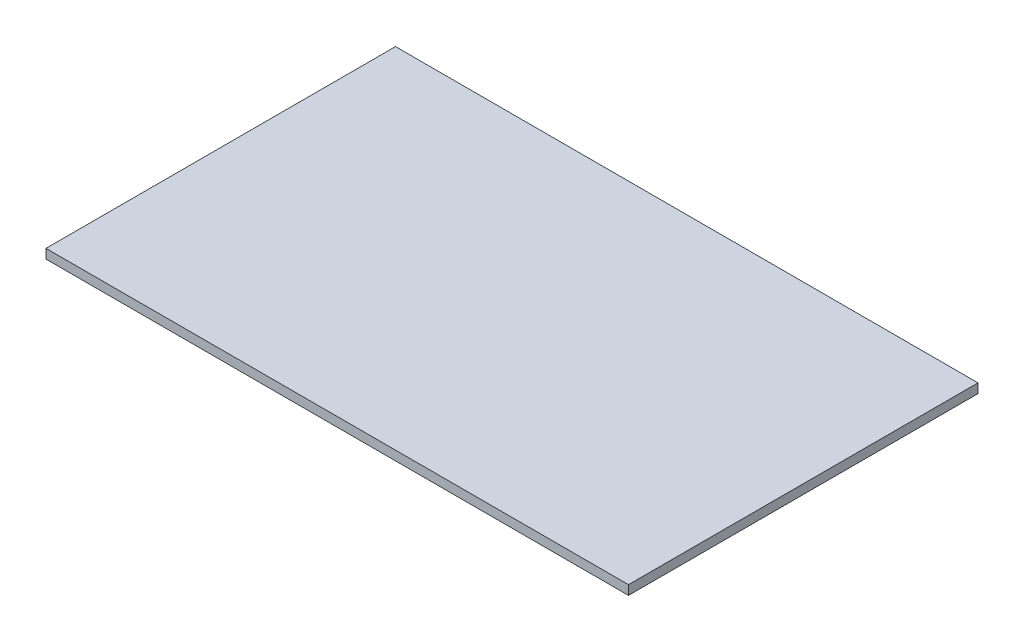
ISO-10303-21;
HEADER;
FILE_DESCRIPTION(('STEP AP214'),'2;1');
FILE_NAME('part.step','',(''),(''),'','','');
FILE_SCHEMA(('AUTOMOTIVE_DESIGN { 1 0 10303 214 1 1 1 1 }'));
ENDSEC;
DATA;
#1=APPLICATION_CONTEXT('core data for automotive mechanical design processes');
#2=APPLICATION_PROTOCOL_DEFINITION('international standard','automotive_design',2000,#1);
#3=PRODUCT_CONTEXT('',#1,'mechanical');
#4=PRODUCT('Part','Part','',(#3));
#5=PRODUCT_RELATED_PRODUCT_CATEGORY('part','',(#4));
#6=PRODUCT_DEFINITION_FORMATION('','',#4);
#7=PRODUCT_DEFINITION_CONTEXT('part definition',#1,'design');
#8=PRODUCT_DEFINITION('design','',#6,#7);
#9=PRODUCT_DEFINITION_SHAPE('','',#8);
#10=(LENGTH_UNIT() NAMED_UNIT(*) SI_UNIT(.MILLI.,.METRE.));
#11=(NAMED_UNIT(*) PLANE_ANGLE_UNIT() SI_UNIT($,.RADIAN.));
#12=(NAMED_UNIT(*) SI_UNIT($,.STERADIAN.) SOLID_ANGLE_UNIT());
#13=UNCERTAINTY_MEASURE_WITH_UNIT(LENGTH_MEASURE(1.E-05),#10,'distance_accuracy_value','');
#14=(GEOMETRIC_REPRESENTATION_CONTEXT(3) GLOBAL_UNCERTAINTY_ASSIGNED_CONTEXT((#13)) GLOBAL_UNIT_ASSIGNED_CONTEXT((#10,
#11,#12)) REPRESENTATION_CONTEXT('',''));
#15=CARTESIAN_POINT('',(0.,0.,0.));
#16=DIRECTION('',(0.,0.,1.));
#17=DIRECTION('',(1.,0.,0.));
#18=AXIS2_PLACEMENT_3D('',#15,#16,#17);
#19=CARTESIAN_POINT('',(50.,1.6,30.));
#20=DIRECTION('',(-1.,0.,0.));
#21=DIRECTION('',(0.,0.,1.));
#22=AXIS2_PLACEMENT_3D('',#19,#20,#21);
#23=PLANE('',#22);
#24=DIRECTION('',(0.,0.,-1.));
#25=VECTOR('',#24,1.);
#26=CARTESIAN_POINT('',(50.,0.,30.));
#27=LINE('',#26,#25);
#28=CARTESIAN_POINT('',(50.,0.,30.));
#29=VERTEX_POINT('',#28);
#30=CARTESIAN_POINT('',(50.,0.,-30.));
#31=VERTEX_POINT('',#30);
#32=EDGE_CURVE('E96',#29,#31,#27,.T.);
#33=ORIENTED_EDGE('',*,*,#32,.T.);
#34=DIRECTION('',(0.,-1.,0.));
#35=VECTOR('',#34,1.);
#36=CARTESIAN_POINT('',(50.,1.6,-30.));
#37=LINE('',#36,#35);
#38=CARTESIAN_POINT('',(50.,1.6,-30.));
#39=VERTEX_POINT('',#38);
#40=EDGE_CURVE('E11',#39,#31,#37,.T.);
#41=ORIENTED_EDGE('',*,*,#40,.F.);
#42=DIRECTION('',(0.,0.,-1.));
#43=VECTOR('',#42,1.);
#44=CARTESIAN_POINT('',(50.,1.6,30.));
#45=LINE('',#44,#43);
#46=CARTESIAN_POINT('',(50.,1.6,30.));
#47=VERTEX_POINT('',#46);
#48=EDGE_CURVE('E84',#47,#39,#45,.T.);
#49=ORIENTED_EDGE('',*,*,#48,.F.);
#50=DIRECTION('',(0.,-1.,0.));
#51=VECTOR('',#50,1.);
#52=CARTESIAN_POINT('',(50.,1.6,30.));
#53=LINE('',#52,#51);
#54=EDGE_CURVE('E92',#47,#29,#53,.T.);
#55=ORIENTED_EDGE('',*,*,#54,.T.);
#56=EDGE_LOOP('',(#33,#41,#49,#55));
#57=FACE_BOUND('',#56,.T.);
#58=ADVANCED_FACE('F33',(#57),#23,.F.);
#59=CARTESIAN_POINT('',(-50.,1.6,-30.));
#60=DIRECTION('',(0.,0.,1.));
#61=DIRECTION('',(1.,0.,0.));
#62=AXIS2_PLACEMENT_3D('',#59,#60,#61);
#63=PLANE('',#62);
#64=DIRECTION('',(-1.,0.,0.));
#65=VECTOR('',#64,1.);
#66=CARTESIAN_POINT('',(-50.,0.,-30.));
#67=LINE('',#66,#65);
#68=CARTESIAN_POINT('',(-50.,0.,-30.));
#69=VERTEX_POINT('',#68);
#70=EDGE_CURVE('E88',#31,#69,#67,.T.);
#71=ORIENTED_EDGE('',*,*,#70,.T.);
#72=DIRECTION('',(0.,-1.,0.));
#73=VECTOR('',#72,1.);
#74=CARTESIAN_POINT('',(-50.,1.6,-30.));
#75=LINE('',#74,#73);
#76=CARTESIAN_POINT('',(-50.,1.6,-30.));
#77=VERTEX_POINT('',#76);
#78=EDGE_CURVE('E41',#77,#69,#75,.T.);
#79=ORIENTED_EDGE('',*,*,#78,.F.);
#80=DIRECTION('',(-1.,0.,0.));
#81=VECTOR('',#80,1.);
#82=CARTESIAN_POINT('',(-50.,1.6,-30.));
#83=LINE('',#82,#81);
#84=EDGE_CURVE('E79',#39,#77,#83,.T.);
#85=ORIENTED_EDGE('',*,*,#84,.F.);
#86=ORIENTED_EDGE('',*,*,#40,.T.);
#87=EDGE_LOOP('',(#71,#79,#85,#86));
#88=FACE_BOUND('',#87,.T.);
#89=ADVANCED_FACE('F87',(#88),#63,.F.);
#90=CARTESIAN_POINT('',(-50.,1.6,30.));
#91=DIRECTION('',(1.,0.,0.));
#92=DIRECTION('',(0.,0.,-1.));
#93=AXIS2_PLACEMENT_3D('',#90,#91,#92);
#94=PLANE('',#93);
#95=DIRECTION('',(0.,0.,1.));
#96=VECTOR('',#95,1.);
#97=CARTESIAN_POINT('',(-50.,0.,30.));
#98=LINE('',#97,#96);
#99=CARTESIAN_POINT('',(-50.,0.,30.));
#100=VERTEX_POINT('',#99);
#101=EDGE_CURVE('E66',#69,#100,#98,.T.);
#102=ORIENTED_EDGE('',*,*,#101,.T.);
#103=DIRECTION('',(0.,-1.,0.));
#104=VECTOR('',#103,1.);
#105=CARTESIAN_POINT('',(-50.,1.6,30.));
#106=LINE('',#105,#104);
#107=CARTESIAN_POINT('',(-50.,1.6,30.));
#108=VERTEX_POINT('',#107);
#109=EDGE_CURVE('E89',#108,#100,#106,.T.);
#110=ORIENTED_EDGE('',*,*,#109,.F.);
#111=DIRECTION('',(0.,0.,1.));
#112=VECTOR('',#111,1.);
#113=CARTESIAN_POINT('',(-50.,1.6,30.));
#114=LINE('',#113,#112);
#115=EDGE_CURVE('E82',#77,#108,#114,.T.);
#116=ORIENTED_EDGE('',*,*,#115,.F.);
#117=ORIENTED_EDGE('',*,*,#78,.T.);
#118=EDGE_LOOP('',(#102,#110,#116,#117));
#119=FACE_BOUND('',#118,.T.);
#120=ADVANCED_FACE('F90',(#119),#94,.F.);
#121=CARTESIAN_POINT('',(-50.,1.6,30.));
#122=DIRECTION('',(0.,0.,-1.));
#123=DIRECTION('',(-1.,0.,0.));
#124=AXIS2_PLACEMENT_3D('',#121,#122,#123);
#125=PLANE('',#124);
#126=DIRECTION('',(1.,0.,0.));
#127=VECTOR('',#126,1.);
#128=CARTESIAN_POINT('',(-50.,0.,30.));
#129=LINE('',#128,#127);
#130=EDGE_CURVE('E72',#100,#29,#129,.T.);
#131=ORIENTED_EDGE('',*,*,#130,.T.);
#132=ORIENTED_EDGE('',*,*,#54,.F.);
#133=DIRECTION('',(1.,0.,0.));
#134=VECTOR('',#133,1.);
#135=CARTESIAN_POINT('',(-50.,1.6,30.));
#136=LINE('',#135,#134);
#137=EDGE_CURVE('E49',#108,#47,#136,.T.);
#138=ORIENTED_EDGE('',*,*,#137,.F.);
#139=ORIENTED_EDGE('',*,*,#109,.T.);
#140=EDGE_LOOP('',(#131,#132,#138,#139));
#141=FACE_BOUND('',#140,.T.);
#142=ADVANCED_FACE('F103',(#141),#125,.F.);
#143=CARTESIAN_POINT('',(0.,1.6,0.));
#144=DIRECTION('',(0.,-1.,0.));
#145=DIRECTION('',(0.,0.,-1.));
#146=AXIS2_PLACEMENT_3D('',#143,#144,#145);
#147=PLANE('',#146);
#148=ORIENTED_EDGE('',*,*,#48,.T.);
#149=ORIENTED_EDGE('',*,*,#84,.T.);
#150=ORIENTED_EDGE('',*,*,#115,.T.);
#151=ORIENTED_EDGE('',*,*,#137,.T.);
#152=EDGE_LOOP('',(#148,#149,#150,#151));
#153=FACE_BOUND('',#152,.T.);
#154=ADVANCED_FACE('F80',(#153),#147,.F.);
#155=CARTESIAN_POINT('',(0.,0.,0.));
#156=DIRECTION('',(0.,-1.,0.));
#157=DIRECTION('',(0.,0.,-1.));
#158=AXIS2_PLACEMENT_3D('',#155,#156,#157);
#159=PLANE('',#158);
#160=ORIENTED_EDGE('',*,*,#32,.F.);
#161=ORIENTED_EDGE('',*,*,#130,.F.);
#162=ORIENTED_EDGE('',*,*,#101,.F.);
#163=ORIENTED_EDGE('',*,*,#70,.F.);
#164=EDGE_LOOP('',(#160,#161,#162,#163));
#165=FACE_BOUND('',#164,.T.);
#166=ADVANCED_FACE('F106',(#165),#159,.T.);
#167=CLOSED_SHELL('',(#58,#89,#120,#142,#154,#166));
#168=MANIFOLD_SOLID_BREP('B2',#167);
#169=ADVANCED_BREP_SHAPE_REPRESENTATION('',(#18,#168),#14);
#170=SHAPE_DEFINITION_REPRESENTATION(#9,#169);
ENDSEC;
END-ISO-10303-21;
